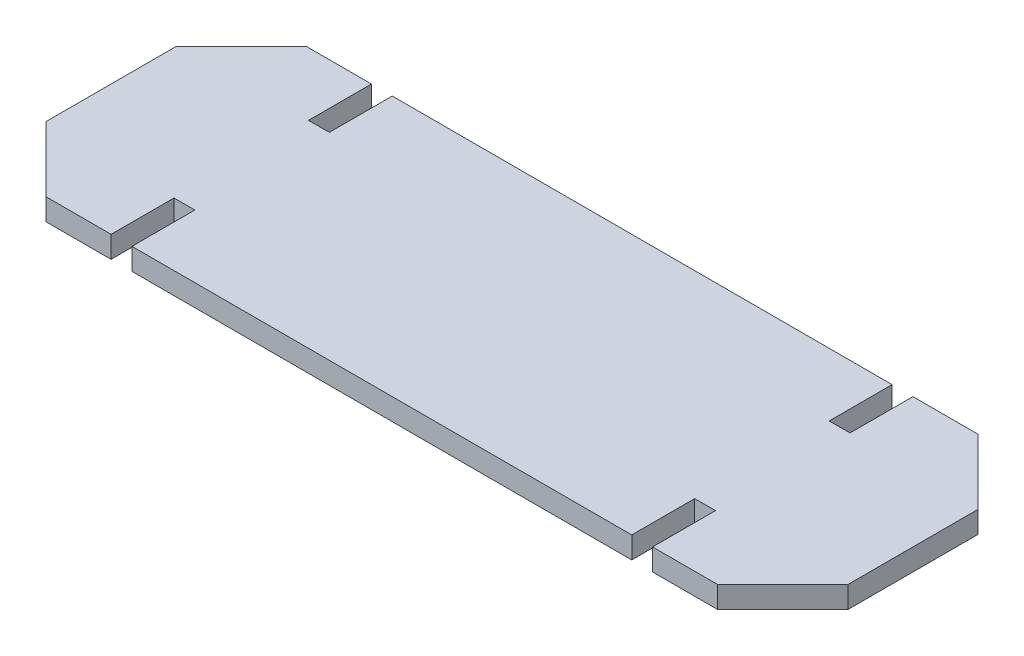
ISO-10303-21;
HEADER;
FILE_DESCRIPTION(('STEP AP214'),'2;1');
FILE_NAME('part.step','',(''),(''),'','','');
FILE_SCHEMA(('AUTOMOTIVE_DESIGN { 1 0 10303 214 1 1 1 1 }'));
ENDSEC;
DATA;
#1=APPLICATION_CONTEXT('core data for automotive mechanical design processes');
#2=APPLICATION_PROTOCOL_DEFINITION('international standard','automotive_design',2000,#1);
#3=PRODUCT_CONTEXT('',#1,'mechanical');
#4=PRODUCT('Part','Part','',(#3));
#5=PRODUCT_RELATED_PRODUCT_CATEGORY('part','',(#4));
#6=PRODUCT_DEFINITION_FORMATION('','',#4);
#7=PRODUCT_DEFINITION_CONTEXT('part definition',#1,'design');
#8=PRODUCT_DEFINITION('design','',#6,#7);
#9=PRODUCT_DEFINITION_SHAPE('','',#8);
#10=(LENGTH_UNIT() NAMED_UNIT(*) SI_UNIT(.MILLI.,.METRE.));
#11=(NAMED_UNIT(*) PLANE_ANGLE_UNIT() SI_UNIT($,.RADIAN.));
#12=(NAMED_UNIT(*) SI_UNIT($,.STERADIAN.) SOLID_ANGLE_UNIT());
#13=UNCERTAINTY_MEASURE_WITH_UNIT(LENGTH_MEASURE(1.E-05),#10,'distance_accuracy_value','');
#14=(GEOMETRIC_REPRESENTATION_CONTEXT(3) GLOBAL_UNCERTAINTY_ASSIGNED_CONTEXT((#13)) GLOBAL_UNIT_ASSIGNED_CONTEXT((#10,
#11,#12)) REPRESENTATION_CONTEXT('',''));
#15=CARTESIAN_POINT('',(0.,0.,0.));
#16=DIRECTION('',(0.,0.,1.));
#17=DIRECTION('',(1.,0.,0.));
#18=AXIS2_PLACEMENT_3D('',#15,#16,#17);
#19=CARTESIAN_POINT('',(0.,12.7,-76.1999999999999));
#20=DIRECTION('',(0.,0.,-1.));
#21=DIRECTION('',(-1.,0.,0.));
#22=AXIS2_PLACEMENT_3D('',#19,#20,#21);
#23=PLANE('',#22);
#24=DIRECTION('',(1.,0.,0.));
#25=VECTOR('',#24,1.);
#26=CARTESIAN_POINT('',(0.,0.,-76.1999999999999));
#27=LINE('',#26,#25);
#28=CARTESIAN_POINT('',(158.496,0.,-76.1999999999999));
#29=VERTEX_POINT('',#28);
#30=CARTESIAN_POINT('',(196.596,0.,-76.1999999999999));
#31=VERTEX_POINT('',#30);
#32=EDGE_CURVE('E226',#29,#31,#27,.T.);
#33=ORIENTED_EDGE('',*,*,#32,.F.);
#34=DIRECTION('',(0.,-1.,0.));
#35=VECTOR('',#34,1.);
#36=CARTESIAN_POINT('',(158.496,12.7,-76.1999999999999));
#37=LINE('',#36,#35);
#38=CARTESIAN_POINT('',(158.496,12.7,-76.1999999999999));
#39=VERTEX_POINT('',#38);
#40=EDGE_CURVE('E11',#39,#29,#37,.T.);
#41=ORIENTED_EDGE('',*,*,#40,.F.);
#42=DIRECTION('',(1.,0.,0.));
#43=VECTOR('',#42,1.);
#44=CARTESIAN_POINT('',(0.,12.7,-76.1999999999999));
#45=LINE('',#44,#43);
#46=CARTESIAN_POINT('',(196.596,12.7,-76.1999999999999));
#47=VERTEX_POINT('',#46);
#48=EDGE_CURVE('E287',#39,#47,#45,.T.);
#49=ORIENTED_EDGE('',*,*,#48,.T.);
#50=DIRECTION('',(0.,-1.,0.));
#51=VECTOR('',#50,1.);
#52=CARTESIAN_POINT('',(196.596,12.7,-76.1999999999999));
#53=LINE('',#52,#51);
#54=EDGE_CURVE('E51',#47,#31,#53,.T.);
#55=ORIENTED_EDGE('',*,*,#54,.T.);
#56=EDGE_LOOP('',(#33,#41,#49,#55));
#57=FACE_BOUND('',#56,.T.);
#58=ADVANCED_FACE('F35',(#57),#23,.T.);
#59=CARTESIAN_POINT('',(158.496,12.7,0.));
#60=DIRECTION('',(1.,0.,0.));
#61=DIRECTION('',(0.,0.,-1.));
#62=AXIS2_PLACEMENT_3D('',#59,#60,#61);
#63=PLANE('',#62);
#64=DIRECTION('',(0.,0.,1.));
#65=VECTOR('',#64,1.);
#66=CARTESIAN_POINT('',(158.496,0.,0.));
#67=LINE('',#66,#65);
#68=CARTESIAN_POINT('',(158.496,0.,-39.37));
#69=VERTEX_POINT('',#68);
#70=EDGE_CURVE('E228',#29,#69,#67,.T.);
#71=ORIENTED_EDGE('',*,*,#70,.T.);
#72=DIRECTION('',(0.,-1.,0.));
#73=VECTOR('',#72,1.);
#74=CARTESIAN_POINT('',(158.496,12.7,-39.37));
#75=LINE('',#74,#73);
#76=CARTESIAN_POINT('',(158.496,12.7,-39.37));
#77=VERTEX_POINT('',#76);
#78=EDGE_CURVE('E43',#77,#69,#75,.T.);
#79=ORIENTED_EDGE('',*,*,#78,.F.);
#80=DIRECTION('',(0.,0.,1.));
#81=VECTOR('',#80,1.);
#82=CARTESIAN_POINT('',(158.496,12.7,0.));
#83=LINE('',#82,#81);
#84=EDGE_CURVE('E354',#39,#77,#83,.T.);
#85=ORIENTED_EDGE('',*,*,#84,.F.);
#86=ORIENTED_EDGE('',*,*,#40,.T.);
#87=EDGE_LOOP('',(#71,#79,#85,#86));
#88=FACE_BOUND('',#87,.T.);
#89=ADVANCED_FACE('F341',(#88),#63,.F.);
#90=CARTESIAN_POINT('',(0.,12.7,-39.37));
#91=DIRECTION('',(0.,0.,-1.));
#92=DIRECTION('',(-1.,0.,0.));
#93=AXIS2_PLACEMENT_3D('',#90,#91,#92);
#94=PLANE('',#93);
#95=DIRECTION('',(1.,0.,0.));
#96=VECTOR('',#95,1.);
#97=CARTESIAN_POINT('',(0.,0.,-39.37));
#98=LINE('',#97,#96);
#99=CARTESIAN_POINT('',(146.304,0.,-39.37));
#100=VERTEX_POINT('',#99);
#101=EDGE_CURVE('E231',#100,#69,#98,.T.);
#102=ORIENTED_EDGE('',*,*,#101,.F.);
#103=DIRECTION('',(0.,-1.,0.));
#104=VECTOR('',#103,1.);
#105=CARTESIAN_POINT('',(146.304,12.7,-39.37));
#106=LINE('',#105,#104);
#107=CARTESIAN_POINT('',(146.304,12.7,-39.37));
#108=VERTEX_POINT('',#107);
#109=EDGE_CURVE('E331',#108,#100,#106,.T.);
#110=ORIENTED_EDGE('',*,*,#109,.F.);
#111=DIRECTION('',(1.,0.,0.));
#112=VECTOR('',#111,1.);
#113=CARTESIAN_POINT('',(0.,12.7,-39.37));
#114=LINE('',#113,#112);
#115=EDGE_CURVE('E338',#108,#77,#114,.T.);
#116=ORIENTED_EDGE('',*,*,#115,.T.);
#117=ORIENTED_EDGE('',*,*,#78,.T.);
#118=EDGE_LOOP('',(#102,#110,#116,#117));
#119=FACE_BOUND('',#118,.T.);
#120=ADVANCED_FACE('F336',(#119),#94,.T.);
#121=CARTESIAN_POINT('',(146.304,12.7,0.));
#122=DIRECTION('',(1.,0.,0.));
#123=DIRECTION('',(0.,0.,-1.));
#124=AXIS2_PLACEMENT_3D('',#121,#122,#123);
#125=PLANE('',#124);
#126=DIRECTION('',(0.,0.,1.));
#127=VECTOR('',#126,1.);
#128=CARTESIAN_POINT('',(146.304,0.,0.));
#129=LINE('',#128,#127);
#130=CARTESIAN_POINT('',(146.304,0.,-76.1999999999999));
#131=VERTEX_POINT('',#130);
#132=EDGE_CURVE('E234',#131,#100,#129,.T.);
#133=ORIENTED_EDGE('',*,*,#132,.F.);
#134=DIRECTION('',(0.,-1.,0.));
#135=VECTOR('',#134,1.);
#136=CARTESIAN_POINT('',(146.304,12.7,-76.1999999999999));
#137=LINE('',#136,#135);
#138=CARTESIAN_POINT('',(146.304,12.7,-76.1999999999999));
#139=VERTEX_POINT('',#138);
#140=EDGE_CURVE('E329',#139,#131,#137,.T.);
#141=ORIENTED_EDGE('',*,*,#140,.F.);
#142=DIRECTION('',(0.,0.,1.));
#143=VECTOR('',#142,1.);
#144=CARTESIAN_POINT('',(146.304,12.7,0.));
#145=LINE('',#144,#143);
#146=EDGE_CURVE('E351',#139,#108,#145,.T.);
#147=ORIENTED_EDGE('',*,*,#146,.T.);
#148=ORIENTED_EDGE('',*,*,#109,.T.);
#149=EDGE_LOOP('',(#133,#141,#147,#148));
#150=FACE_BOUND('',#149,.T.);
#151=ADVANCED_FACE('F348',(#150),#125,.T.);
#152=CARTESIAN_POINT('',(0.,12.7,-76.1999999999999));
#153=DIRECTION('',(0.,0.,-1.));
#154=DIRECTION('',(-1.,0.,0.));
#155=AXIS2_PLACEMENT_3D('',#152,#153,#154);
#156=PLANE('',#155);
#157=DIRECTION('',(1.,0.,0.));
#158=VECTOR('',#157,1.);
#159=CARTESIAN_POINT('',(0.,0.,-76.1999999999999));
#160=LINE('',#159,#158);
#161=CARTESIAN_POINT('',(-146.304,0.,-76.1999999999999));
#162=VERTEX_POINT('',#161);
#163=EDGE_CURVE('E237',#162,#131,#160,.T.);
#164=ORIENTED_EDGE('',*,*,#163,.F.);
#165=DIRECTION('',(0.,-1.,0.));
#166=VECTOR('',#165,1.);
#167=CARTESIAN_POINT('',(-146.304,12.7,-76.1999999999999));
#168=LINE('',#167,#166);
#169=CARTESIAN_POINT('',(-146.304,12.7,-76.1999999999999));
#170=VERTEX_POINT('',#169);
#171=EDGE_CURVE('E327',#170,#162,#168,.T.);
#172=ORIENTED_EDGE('',*,*,#171,.F.);
#173=DIRECTION('',(1.,0.,0.));
#174=VECTOR('',#173,1.);
#175=CARTESIAN_POINT('',(0.,12.7,-76.1999999999999));
#176=LINE('',#175,#174);
#177=EDGE_CURVE('E356',#170,#139,#176,.T.);
#178=ORIENTED_EDGE('',*,*,#177,.T.);
#179=ORIENTED_EDGE('',*,*,#140,.T.);
#180=EDGE_LOOP('',(#164,#172,#178,#179));
#181=FACE_BOUND('',#180,.T.);
#182=ADVANCED_FACE('F604',(#181),#156,.T.);
#183=CARTESIAN_POINT('',(-146.304,12.7,0.));
#184=DIRECTION('',(1.,0.,0.));
#185=DIRECTION('',(0.,0.,-1.));
#186=AXIS2_PLACEMENT_3D('',#183,#184,#185);
#187=PLANE('',#186);
#188=DIRECTION('',(0.,0.,1.));
#189=VECTOR('',#188,1.);
#190=CARTESIAN_POINT('',(-146.304,0.,0.));
#191=LINE('',#190,#189);
#192=CARTESIAN_POINT('',(-146.304,0.,-39.37));
#193=VERTEX_POINT('',#192);
#194=EDGE_CURVE('E240',#162,#193,#191,.T.);
#195=ORIENTED_EDGE('',*,*,#194,.T.);
#196=DIRECTION('',(0.,-1.,0.));
#197=VECTOR('',#196,1.);
#198=CARTESIAN_POINT('',(-146.304,12.7,-39.37));
#199=LINE('',#198,#197);
#200=CARTESIAN_POINT('',(-146.304,12.7,-39.37));
#201=VERTEX_POINT('',#200);
#202=EDGE_CURVE('E325',#201,#193,#199,.T.);
#203=ORIENTED_EDGE('',*,*,#202,.F.);
#204=DIRECTION('',(0.,0.,1.));
#205=VECTOR('',#204,1.);
#206=CARTESIAN_POINT('',(-146.304,12.7,0.));
#207=LINE('',#206,#205);
#208=EDGE_CURVE('E362',#170,#201,#207,.T.);
#209=ORIENTED_EDGE('',*,*,#208,.F.);
#210=ORIENTED_EDGE('',*,*,#171,.T.);
#211=EDGE_LOOP('',(#195,#203,#209,#210));
#212=FACE_BOUND('',#211,.T.);
#213=ADVANCED_FACE('F594',(#212),#187,.F.);
#214=CARTESIAN_POINT('',(0.,12.7,-39.37));
#215=DIRECTION('',(0.,0.,-1.));
#216=DIRECTION('',(-1.,0.,0.));
#217=AXIS2_PLACEMENT_3D('',#214,#215,#216);
#218=PLANE('',#217);
#219=DIRECTION('',(1.,0.,0.));
#220=VECTOR('',#219,1.);
#221=CARTESIAN_POINT('',(0.,0.,-39.37));
#222=LINE('',#221,#220);
#223=CARTESIAN_POINT('',(-158.496,0.,-39.37));
#224=VERTEX_POINT('',#223);
#225=EDGE_CURVE('E243',#224,#193,#222,.T.);
#226=ORIENTED_EDGE('',*,*,#225,.F.);
#227=DIRECTION('',(0.,-1.,0.));
#228=VECTOR('',#227,1.);
#229=CARTESIAN_POINT('',(-158.496,12.7,-39.37));
#230=LINE('',#229,#228);
#231=CARTESIAN_POINT('',(-158.496,12.7,-39.37));
#232=VERTEX_POINT('',#231);
#233=EDGE_CURVE('E323',#232,#224,#230,.T.);
#234=ORIENTED_EDGE('',*,*,#233,.F.);
#235=DIRECTION('',(1.,0.,0.));
#236=VECTOR('',#235,1.);
#237=CARTESIAN_POINT('',(0.,12.7,-39.37));
#238=LINE('',#237,#236);
#239=EDGE_CURVE('E364',#232,#201,#238,.T.);
#240=ORIENTED_EDGE('',*,*,#239,.T.);
#241=ORIENTED_EDGE('',*,*,#202,.T.);
#242=EDGE_LOOP('',(#226,#234,#240,#241));
#243=FACE_BOUND('',#242,.T.);
#244=ADVANCED_FACE('F584',(#243),#218,.T.);
#245=CARTESIAN_POINT('',(-158.496,12.7,0.));
#246=DIRECTION('',(1.,0.,0.));
#247=DIRECTION('',(0.,0.,-1.));
#248=AXIS2_PLACEMENT_3D('',#245,#246,#247);
#249=PLANE('',#248);
#250=DIRECTION('',(0.,0.,1.));
#251=VECTOR('',#250,1.);
#252=CARTESIAN_POINT('',(-158.496,0.,0.));
#253=LINE('',#252,#251);
#254=CARTESIAN_POINT('',(-158.496,0.,-76.1999999999999));
#255=VERTEX_POINT('',#254);
#256=EDGE_CURVE('E246',#255,#224,#253,.T.);
#257=ORIENTED_EDGE('',*,*,#256,.F.);
#258=DIRECTION('',(0.,-1.,0.));
#259=VECTOR('',#258,1.);
#260=CARTESIAN_POINT('',(-158.496,12.7,-76.1999999999999));
#261=LINE('',#260,#259);
#262=CARTESIAN_POINT('',(-158.496,12.7,-76.1999999999999));
#263=VERTEX_POINT('',#262);
#264=EDGE_CURVE('E321',#263,#255,#261,.T.);
#265=ORIENTED_EDGE('',*,*,#264,.F.);
#266=DIRECTION('',(0.,0.,1.));
#267=VECTOR('',#266,1.);
#268=CARTESIAN_POINT('',(-158.496,12.7,0.));
#269=LINE('',#268,#267);
#270=EDGE_CURVE('E367',#263,#232,#269,.T.);
#271=ORIENTED_EDGE('',*,*,#270,.T.);
#272=ORIENTED_EDGE('',*,*,#233,.T.);
#273=EDGE_LOOP('',(#257,#265,#271,#272));
#274=FACE_BOUND('',#273,.T.);
#275=ADVANCED_FACE('F574',(#274),#249,.T.);
#276=CARTESIAN_POINT('',(0.,12.7,-76.1999999999999));
#277=DIRECTION('',(0.,0.,-1.));
#278=DIRECTION('',(-1.,0.,0.));
#279=AXIS2_PLACEMENT_3D('',#276,#277,#278);
#280=PLANE('',#279);
#281=DIRECTION('',(1.,0.,0.));
#282=VECTOR('',#281,1.);
#283=CARTESIAN_POINT('',(0.,0.,-76.1999999999999));
#284=LINE('',#283,#282);
#285=CARTESIAN_POINT('',(-196.596,0.,-76.1999999999999));
#286=VERTEX_POINT('',#285);
#287=EDGE_CURVE('E249',#286,#255,#284,.T.);
#288=ORIENTED_EDGE('',*,*,#287,.F.);
#289=DIRECTION('',(0.,-1.,0.));
#290=VECTOR('',#289,1.);
#291=CARTESIAN_POINT('',(-196.596,12.7,-76.1999999999999));
#292=LINE('',#291,#290);
#293=CARTESIAN_POINT('',(-196.596,12.7,-76.1999999999999));
#294=VERTEX_POINT('',#293);
#295=EDGE_CURVE('E319',#294,#286,#292,.T.);
#296=ORIENTED_EDGE('',*,*,#295,.F.);
#297=DIRECTION('',(1.,0.,0.));
#298=VECTOR('',#297,1.);
#299=CARTESIAN_POINT('',(0.,12.7,-76.1999999999999));
#300=LINE('',#299,#298);
#301=EDGE_CURVE('E370',#294,#263,#300,.T.);
#302=ORIENTED_EDGE('',*,*,#301,.T.);
#303=ORIENTED_EDGE('',*,*,#264,.T.);
#304=EDGE_LOOP('',(#288,#296,#302,#303));
#305=FACE_BOUND('',#304,.T.);
#306=ADVANCED_FACE('F564',(#305),#280,.T.);
#307=CARTESIAN_POINT('',(-136.398000000001,12.7,-136.398));
#308=DIRECTION('',(-0.707106781186551,0.,-0.707106781186543));
#309=DIRECTION('',(-0.707106781186544,0.,0.707106781186551));
#310=AXIS2_PLACEMENT_3D('',#307,#308,#309);
#311=PLANE('',#310);
#312=DIRECTION('',(0.707106781186544,0.,-0.707106781186551));
#313=VECTOR('',#312,1.);
#314=CARTESIAN_POINT('',(-136.398000000001,0.,-136.398));
#315=LINE('',#314,#313);
#316=CARTESIAN_POINT('',(-234.696,0.,-38.1));
#317=VERTEX_POINT('',#316);
#318=EDGE_CURVE('E252',#317,#286,#315,.T.);
#319=ORIENTED_EDGE('',*,*,#318,.F.);
#320=DIRECTION('',(0.,-1.,0.));
#321=VECTOR('',#320,1.);
#322=CARTESIAN_POINT('',(-234.696,12.7,-38.1));
#323=LINE('',#322,#321);
#324=CARTESIAN_POINT('',(-234.696,12.7,-38.1));
#325=VERTEX_POINT('',#324);
#326=EDGE_CURVE('E317',#325,#317,#323,.T.);
#327=ORIENTED_EDGE('',*,*,#326,.F.);
#328=DIRECTION('',(0.707106781186544,0.,-0.707106781186551));
#329=VECTOR('',#328,1.);
#330=CARTESIAN_POINT('',(-136.398000000001,12.7,-136.398));
#331=LINE('',#330,#329);
#332=EDGE_CURVE('E373',#325,#294,#331,.T.);
#333=ORIENTED_EDGE('',*,*,#332,.T.);
#334=ORIENTED_EDGE('',*,*,#295,.T.);
#335=EDGE_LOOP('',(#319,#327,#333,#334));
#336=FACE_BOUND('',#335,.T.);
#337=ADVANCED_FACE('F554',(#336),#311,.T.);
#338=CARTESIAN_POINT('',(-234.696,12.7,1.70974345792274E-13));
#339=DIRECTION('',(1.,0.,0.));
#340=DIRECTION('',(0.,0.,-1.));
#341=AXIS2_PLACEMENT_3D('',#338,#339,#340);
#342=PLANE('',#341);
#343=DIRECTION('',(0.,0.,1.));
#344=VECTOR('',#343,1.);
#345=CARTESIAN_POINT('',(-234.696,0.,1.70974345792274E-13));
#346=LINE('',#345,#344);
#347=CARTESIAN_POINT('',(-234.696,0.,38.1));
#348=VERTEX_POINT('',#347);
#349=EDGE_CURVE('E255',#317,#348,#346,.T.);
#350=ORIENTED_EDGE('',*,*,#349,.T.);
#351=DIRECTION('',(0.,-1.,0.));
#352=VECTOR('',#351,1.);
#353=CARTESIAN_POINT('',(-234.696,12.7,38.1));
#354=LINE('',#353,#352);
#355=CARTESIAN_POINT('',(-234.696,12.7,38.1));
#356=VERTEX_POINT('',#355);
#357=EDGE_CURVE('E314',#356,#348,#354,.T.);
#358=ORIENTED_EDGE('',*,*,#357,.F.);
#359=DIRECTION('',(0.,0.,1.));
#360=VECTOR('',#359,1.);
#361=CARTESIAN_POINT('',(-234.696,12.7,1.70974345792274E-13));
#362=LINE('',#361,#360);
#363=EDGE_CURVE('E376',#325,#356,#362,.T.);
#364=ORIENTED_EDGE('',*,*,#363,.F.);
#365=ORIENTED_EDGE('',*,*,#326,.T.);
#366=EDGE_LOOP('',(#350,#358,#364,#365));
#367=FACE_BOUND('',#366,.T.);
#368=ADVANCED_FACE('F544',(#367),#342,.F.);
#369=CARTESIAN_POINT('',(-136.397999999999,12.7,136.398));
#370=DIRECTION('',(0.707106781186546,0.,-0.707106781186549));
#371=DIRECTION('',(-0.707106781186549,0.,-0.707106781186546));
#372=AXIS2_PLACEMENT_3D('',#369,#370,#371);
#373=PLANE('',#372);
#374=DIRECTION('',(0.707106781186549,0.,0.707106781186546));
#375=VECTOR('',#374,1.);
#376=CARTESIAN_POINT('',(-136.397999999999,0.,136.398));
#377=LINE('',#376,#375);
#378=CARTESIAN_POINT('',(-196.596,0.,76.2));
#379=VERTEX_POINT('',#378);
#380=EDGE_CURVE('E257',#348,#379,#377,.T.);
#381=ORIENTED_EDGE('',*,*,#380,.T.);
#382=DIRECTION('',(0.,-1.,0.));
#383=VECTOR('',#382,1.);
#384=CARTESIAN_POINT('',(-196.596,12.7,76.2));
#385=LINE('',#384,#383);
#386=CARTESIAN_POINT('',(-196.596,12.7,76.2));
#387=VERTEX_POINT('',#386);
#388=EDGE_CURVE('E311',#387,#379,#385,.T.);
#389=ORIENTED_EDGE('',*,*,#388,.F.);
#390=DIRECTION('',(0.707106781186549,0.,0.707106781186546));
#391=VECTOR('',#390,1.);
#392=CARTESIAN_POINT('',(-136.397999999999,12.7,136.398));
#393=LINE('',#392,#391);
#394=EDGE_CURVE('E378',#356,#387,#393,.T.);
#395=ORIENTED_EDGE('',*,*,#394,.F.);
#396=ORIENTED_EDGE('',*,*,#357,.T.);
#397=EDGE_LOOP('',(#381,#389,#395,#396));
#398=FACE_BOUND('',#397,.T.);
#399=ADVANCED_FACE('F534',(#398),#373,.F.);
#400=CARTESIAN_POINT('',(0.,12.7,76.2));
#401=DIRECTION('',(0.,0.,-1.));
#402=DIRECTION('',(-1.,0.,0.));
#403=AXIS2_PLACEMENT_3D('',#400,#401,#402);
#404=PLANE('',#403);
#405=DIRECTION('',(1.,0.,0.));
#406=VECTOR('',#405,1.);
#407=CARTESIAN_POINT('',(0.,0.,76.2));
#408=LINE('',#407,#406);
#409=CARTESIAN_POINT('',(-158.496,0.,76.2));
#410=VERTEX_POINT('',#409);
#411=EDGE_CURVE('E259',#379,#410,#408,.T.);
#412=ORIENTED_EDGE('',*,*,#411,.T.);
#413=DIRECTION('',(0.,-1.,0.));
#414=VECTOR('',#413,1.);
#415=CARTESIAN_POINT('',(-158.496,12.7,76.2));
#416=LINE('',#415,#414);
#417=CARTESIAN_POINT('',(-158.496,12.7,76.2));
#418=VERTEX_POINT('',#417);
#419=EDGE_CURVE('E308',#418,#410,#416,.T.);
#420=ORIENTED_EDGE('',*,*,#419,.F.);
#421=DIRECTION('',(1.,0.,0.));
#422=VECTOR('',#421,1.);
#423=CARTESIAN_POINT('',(0.,12.7,76.2));
#424=LINE('',#423,#422);
#425=EDGE_CURVE('E380',#387,#418,#424,.T.);
#426=ORIENTED_EDGE('',*,*,#425,.F.);
#427=ORIENTED_EDGE('',*,*,#388,.T.);
#428=EDGE_LOOP('',(#412,#420,#426,#427));
#429=FACE_BOUND('',#428,.T.);
#430=ADVANCED_FACE('F524',(#429),#404,.F.);
#431=CARTESIAN_POINT('',(-158.496,12.7,0.));
#432=DIRECTION('',(-1.,0.,0.));
#433=DIRECTION('',(0.,0.,1.));
#434=AXIS2_PLACEMENT_3D('',#431,#432,#433);
#435=PLANE('',#434);
#436=DIRECTION('',(0.,0.,-1.));
#437=VECTOR('',#436,1.);
#438=CARTESIAN_POINT('',(-158.496,0.,0.));
#439=LINE('',#438,#437);
#440=CARTESIAN_POINT('',(-158.496,0.,39.37));
#441=VERTEX_POINT('',#440);
#442=EDGE_CURVE('E261',#410,#441,#439,.T.);
#443=ORIENTED_EDGE('',*,*,#442,.T.);
#444=DIRECTION('',(0.,-1.,0.));
#445=VECTOR('',#444,1.);
#446=CARTESIAN_POINT('',(-158.496,12.7,39.37));
#447=LINE('',#446,#445);
#448=CARTESIAN_POINT('',(-158.496,12.7,39.37));
#449=VERTEX_POINT('',#448);
#450=EDGE_CURVE('E305',#449,#441,#447,.T.);
#451=ORIENTED_EDGE('',*,*,#450,.F.);
#452=DIRECTION('',(0.,0.,-1.));
#453=VECTOR('',#452,1.);
#454=CARTESIAN_POINT('',(-158.496,12.7,0.));
#455=LINE('',#454,#453);
#456=EDGE_CURVE('E382',#418,#449,#455,.T.);
#457=ORIENTED_EDGE('',*,*,#456,.F.);
#458=ORIENTED_EDGE('',*,*,#419,.T.);
#459=EDGE_LOOP('',(#443,#451,#457,#458));
#460=FACE_BOUND('',#459,.T.);
#461=ADVANCED_FACE('F514',(#460),#435,.F.);
#462=CARTESIAN_POINT('',(0.,12.7,39.37));
#463=DIRECTION('',(0.,0.,-1.));
#464=DIRECTION('',(-1.,0.,0.));
#465=AXIS2_PLACEMENT_3D('',#462,#463,#464);
#466=PLANE('',#465);
#467=DIRECTION('',(1.,0.,0.));
#468=VECTOR('',#467,1.);
#469=CARTESIAN_POINT('',(0.,0.,39.37));
#470=LINE('',#469,#468);
#471=CARTESIAN_POINT('',(-146.304,0.,39.37));
#472=VERTEX_POINT('',#471);
#473=EDGE_CURVE('E263',#441,#472,#470,.T.);
#474=ORIENTED_EDGE('',*,*,#473,.T.);
#475=DIRECTION('',(0.,-1.,0.));
#476=VECTOR('',#475,1.);
#477=CARTESIAN_POINT('',(-146.304,12.7,39.37));
#478=LINE('',#477,#476);
#479=CARTESIAN_POINT('',(-146.304,12.7,39.37));
#480=VERTEX_POINT('',#479);
#481=EDGE_CURVE('E303',#480,#472,#478,.T.);
#482=ORIENTED_EDGE('',*,*,#481,.F.);
#483=DIRECTION('',(1.,0.,0.));
#484=VECTOR('',#483,1.);
#485=CARTESIAN_POINT('',(0.,12.7,39.37));
#486=LINE('',#485,#484);
#487=EDGE_CURVE('E384',#449,#480,#486,.T.);
#488=ORIENTED_EDGE('',*,*,#487,.F.);
#489=ORIENTED_EDGE('',*,*,#450,.T.);
#490=EDGE_LOOP('',(#474,#482,#488,#489));
#491=FACE_BOUND('',#490,.T.);
#492=ADVANCED_FACE('F504',(#491),#466,.F.);
#493=CARTESIAN_POINT('',(-146.304,12.7,0.));
#494=DIRECTION('',(-1.,0.,0.));
#495=DIRECTION('',(0.,0.,1.));
#496=AXIS2_PLACEMENT_3D('',#493,#494,#495);
#497=PLANE('',#496);
#498=DIRECTION('',(0.,0.,-1.));
#499=VECTOR('',#498,1.);
#500=CARTESIAN_POINT('',(-146.304,0.,0.));
#501=LINE('',#500,#499);
#502=CARTESIAN_POINT('',(-146.304,0.,76.2));
#503=VERTEX_POINT('',#502);
#504=EDGE_CURVE('E266',#503,#472,#501,.T.);
#505=ORIENTED_EDGE('',*,*,#504,.F.);
#506=DIRECTION('',(0.,-1.,0.));
#507=VECTOR('',#506,1.);
#508=CARTESIAN_POINT('',(-146.304,12.7,76.2));
#509=LINE('',#508,#507);
#510=CARTESIAN_POINT('',(-146.304,12.7,76.2));
#511=VERTEX_POINT('',#510);
#512=EDGE_CURVE('E301',#511,#503,#509,.T.);
#513=ORIENTED_EDGE('',*,*,#512,.F.);
#514=DIRECTION('',(0.,0.,-1.));
#515=VECTOR('',#514,1.);
#516=CARTESIAN_POINT('',(-146.304,12.7,0.));
#517=LINE('',#516,#515);
#518=EDGE_CURVE('E386',#511,#480,#517,.T.);
#519=ORIENTED_EDGE('',*,*,#518,.T.);
#520=ORIENTED_EDGE('',*,*,#481,.T.);
#521=EDGE_LOOP('',(#505,#513,#519,#520));
#522=FACE_BOUND('',#521,.T.);
#523=ADVANCED_FACE('F494',(#522),#497,.T.);
#524=CARTESIAN_POINT('',(0.,12.7,76.2));
#525=DIRECTION('',(0.,0.,-1.));
#526=DIRECTION('',(-1.,0.,0.));
#527=AXIS2_PLACEMENT_3D('',#524,#525,#526);
#528=PLANE('',#527);
#529=DIRECTION('',(1.,0.,0.));
#530=VECTOR('',#529,1.);
#531=CARTESIAN_POINT('',(0.,0.,76.2));
#532=LINE('',#531,#530);
#533=CARTESIAN_POINT('',(146.304,0.,76.2));
#534=VERTEX_POINT('',#533);
#535=EDGE_CURVE('E269',#503,#534,#532,.T.);
#536=ORIENTED_EDGE('',*,*,#535,.T.);
#537=DIRECTION('',(0.,-1.,0.));
#538=VECTOR('',#537,1.);
#539=CARTESIAN_POINT('',(146.304,12.7,76.2));
#540=LINE('',#539,#538);
#541=CARTESIAN_POINT('',(146.304,12.7,76.2));
#542=VERTEX_POINT('',#541);
#543=EDGE_CURVE('E298',#542,#534,#540,.T.);
#544=ORIENTED_EDGE('',*,*,#543,.F.);
#545=DIRECTION('',(1.,0.,0.));
#546=VECTOR('',#545,1.);
#547=CARTESIAN_POINT('',(0.,12.7,76.2));
#548=LINE('',#547,#546);
#549=EDGE_CURVE('E389',#511,#542,#548,.T.);
#550=ORIENTED_EDGE('',*,*,#549,.F.);
#551=ORIENTED_EDGE('',*,*,#512,.T.);
#552=EDGE_LOOP('',(#536,#544,#550,#551));
#553=FACE_BOUND('',#552,.T.);
#554=ADVANCED_FACE('F484',(#553),#528,.F.);
#555=CARTESIAN_POINT('',(146.304,12.7,0.));
#556=DIRECTION('',(-1.,0.,0.));
#557=DIRECTION('',(0.,0.,1.));
#558=AXIS2_PLACEMENT_3D('',#555,#556,#557);
#559=PLANE('',#558);
#560=DIRECTION('',(0.,0.,-1.));
#561=VECTOR('',#560,1.);
#562=CARTESIAN_POINT('',(146.304,0.,0.));
#563=LINE('',#562,#561);
#564=CARTESIAN_POINT('',(146.304,0.,39.37));
#565=VERTEX_POINT('',#564);
#566=EDGE_CURVE('E271',#534,#565,#563,.T.);
#567=ORIENTED_EDGE('',*,*,#566,.T.);
#568=DIRECTION('',(0.,-1.,0.));
#569=VECTOR('',#568,1.);
#570=CARTESIAN_POINT('',(146.304,12.7,39.37));
#571=LINE('',#570,#569);
#572=CARTESIAN_POINT('',(146.304,12.7,39.37));
#573=VERTEX_POINT('',#572);
#574=EDGE_CURVE('E295',#573,#565,#571,.T.);
#575=ORIENTED_EDGE('',*,*,#574,.F.);
#576=DIRECTION('',(0.,0.,-1.));
#577=VECTOR('',#576,1.);
#578=CARTESIAN_POINT('',(146.304,12.7,0.));
#579=LINE('',#578,#577);
#580=EDGE_CURVE('E391',#542,#573,#579,.T.);
#581=ORIENTED_EDGE('',*,*,#580,.F.);
#582=ORIENTED_EDGE('',*,*,#543,.T.);
#583=EDGE_LOOP('',(#567,#575,#581,#582));
#584=FACE_BOUND('',#583,.T.);
#585=ADVANCED_FACE('F475',(#584),#559,.F.);
#586=CARTESIAN_POINT('',(0.,12.7,39.37));
#587=DIRECTION('',(0.,0.,-1.));
#588=DIRECTION('',(-1.,0.,0.));
#589=AXIS2_PLACEMENT_3D('',#586,#587,#588);
#590=PLANE('',#589);
#591=DIRECTION('',(1.,0.,0.));
#592=VECTOR('',#591,1.);
#593=CARTESIAN_POINT('',(0.,0.,39.37));
#594=LINE('',#593,#592);
#595=CARTESIAN_POINT('',(158.496,0.,39.37));
#596=VERTEX_POINT('',#595);
#597=EDGE_CURVE('E273',#565,#596,#594,.T.);
#598=ORIENTED_EDGE('',*,*,#597,.T.);
#599=DIRECTION('',(0.,-1.,0.));
#600=VECTOR('',#599,1.);
#601=CARTESIAN_POINT('',(158.496,12.7,39.37));
#602=LINE('',#601,#600);
#603=CARTESIAN_POINT('',(158.496,12.7,39.37));
#604=VERTEX_POINT('',#603);
#605=EDGE_CURVE('E293',#604,#596,#602,.T.);
#606=ORIENTED_EDGE('',*,*,#605,.F.);
#607=DIRECTION('',(1.,0.,0.));
#608=VECTOR('',#607,1.);
#609=CARTESIAN_POINT('',(0.,12.7,39.37));
#610=LINE('',#609,#608);
#611=EDGE_CURVE('E393',#573,#604,#610,.T.);
#612=ORIENTED_EDGE('',*,*,#611,.F.);
#613=ORIENTED_EDGE('',*,*,#574,.T.);
#614=EDGE_LOOP('',(#598,#606,#612,#613));
#615=FACE_BOUND('',#614,.T.);
#616=ADVANCED_FACE('F405',(#615),#590,.F.);
#617=CARTESIAN_POINT('',(158.496,12.7,0.));
#618=DIRECTION('',(-1.,0.,0.));
#619=DIRECTION('',(0.,0.,1.));
#620=AXIS2_PLACEMENT_3D('',#617,#618,#619);
#621=PLANE('',#620);
#622=DIRECTION('',(0.,0.,-1.));
#623=VECTOR('',#622,1.);
#624=CARTESIAN_POINT('',(158.496,0.,0.));
#625=LINE('',#624,#623);
#626=CARTESIAN_POINT('',(158.496,0.,76.2));
#627=VERTEX_POINT('',#626);
#628=EDGE_CURVE('E276',#627,#596,#625,.T.);
#629=ORIENTED_EDGE('',*,*,#628,.F.);
#630=DIRECTION('',(0.,-1.,0.));
#631=VECTOR('',#630,1.);
#632=CARTESIAN_POINT('',(158.496,12.7,76.2));
#633=LINE('',#632,#631);
#634=CARTESIAN_POINT('',(158.496,12.7,76.2));
#635=VERTEX_POINT('',#634);
#636=EDGE_CURVE('E291',#635,#627,#633,.T.);
#637=ORIENTED_EDGE('',*,*,#636,.F.);
#638=DIRECTION('',(0.,0.,-1.));
#639=VECTOR('',#638,1.);
#640=CARTESIAN_POINT('',(158.496,12.7,0.));
#641=LINE('',#640,#639);
#642=EDGE_CURVE('E395',#635,#604,#641,.T.);
#643=ORIENTED_EDGE('',*,*,#642,.T.);
#644=ORIENTED_EDGE('',*,*,#605,.T.);
#645=EDGE_LOOP('',(#629,#637,#643,#644));
#646=FACE_BOUND('',#645,.T.);
#647=ADVANCED_FACE('F399',(#646),#621,.T.);
#648=CARTESIAN_POINT('',(0.,12.7,76.2));
#649=DIRECTION('',(0.,0.,-1.));
#650=DIRECTION('',(-1.,0.,0.));
#651=AXIS2_PLACEMENT_3D('',#648,#649,#650);
#652=PLANE('',#651);
#653=DIRECTION('',(1.,0.,0.));
#654=VECTOR('',#653,1.);
#655=CARTESIAN_POINT('',(0.,0.,76.2));
#656=LINE('',#655,#654);
#657=CARTESIAN_POINT('',(196.596000000001,0.,76.2));
#658=VERTEX_POINT('',#657);
#659=EDGE_CURVE('E279',#627,#658,#656,.T.);
#660=ORIENTED_EDGE('',*,*,#659,.T.);
#661=DIRECTION('',(0.,-1.,0.));
#662=VECTOR('',#661,1.);
#663=CARTESIAN_POINT('',(196.596000000001,12.7,76.2));
#664=LINE('',#663,#662);
#665=CARTESIAN_POINT('',(196.596000000001,12.7,76.2));
#666=VERTEX_POINT('',#665);
#667=EDGE_CURVE('E218',#666,#658,#664,.T.);
#668=ORIENTED_EDGE('',*,*,#667,.F.);
#669=DIRECTION('',(1.,0.,0.));
#670=VECTOR('',#669,1.);
#671=CARTESIAN_POINT('',(0.,12.7,76.2));
#672=LINE('',#671,#670);
#673=EDGE_CURVE('E206',#635,#666,#672,.T.);
#674=ORIENTED_EDGE('',*,*,#673,.F.);
#675=ORIENTED_EDGE('',*,*,#636,.T.);
#676=EDGE_LOOP('',(#660,#668,#674,#675));
#677=FACE_BOUND('',#676,.T.);
#678=ADVANCED_FACE('F410',(#677),#652,.F.);
#679=CARTESIAN_POINT('',(136.398000000002,12.7,136.398));
#680=DIRECTION('',(-0.707106781186552,0.,-0.707106781186542));
#681=DIRECTION('',(-0.707106781186543,0.,0.707106781186553));
#682=AXIS2_PLACEMENT_3D('',#679,#680,#681);
#683=PLANE('',#682);
#684=DIRECTION('',(0.707106781186543,0.,-0.707106781186553));
#685=VECTOR('',#684,1.);
#686=CARTESIAN_POINT('',(136.398000000002,0.,136.398));
#687=LINE('',#686,#685);
#688=CARTESIAN_POINT('',(234.696,0.,38.1));
#689=VERTEX_POINT('',#688);
#690=EDGE_CURVE('E215',#658,#689,#687,.T.);
#691=ORIENTED_EDGE('',*,*,#690,.T.);
#692=DIRECTION('',(0.,-1.,0.));
#693=VECTOR('',#692,1.);
#694=CARTESIAN_POINT('',(234.696,12.7,38.1));
#695=LINE('',#694,#693);
#696=CARTESIAN_POINT('',(234.696,12.7,38.1));
#697=VERTEX_POINT('',#696);
#698=EDGE_CURVE('E212',#697,#689,#695,.T.);
#699=ORIENTED_EDGE('',*,*,#698,.F.);
#700=DIRECTION('',(0.707106781186543,0.,-0.707106781186553));
#701=VECTOR('',#700,1.);
#702=CARTESIAN_POINT('',(136.398000000002,12.7,136.398));
#703=LINE('',#702,#701);
#704=EDGE_CURVE('E197',#666,#697,#703,.T.);
#705=ORIENTED_EDGE('',*,*,#704,.F.);
#706=ORIENTED_EDGE('',*,*,#667,.T.);
#707=EDGE_LOOP('',(#691,#699,#705,#706));
#708=FACE_BOUND('',#707,.T.);
#709=ADVANCED_FACE('F213',(#708),#683,.F.);
#710=CARTESIAN_POINT('',(234.696,12.7,0.));
#711=DIRECTION('',(1.,0.,0.));
#712=DIRECTION('',(0.,0.,-1.));
#713=AXIS2_PLACEMENT_3D('',#710,#711,#712);
#714=PLANE('',#713);
#715=DIRECTION('',(0.,0.,1.));
#716=VECTOR('',#715,1.);
#717=CARTESIAN_POINT('',(234.696,0.,0.));
#718=LINE('',#717,#716);
#719=CARTESIAN_POINT('',(234.696,0.,-38.0999999999999));
#720=VERTEX_POINT('',#719);
#721=EDGE_CURVE('E282',#720,#689,#718,.T.);
#722=ORIENTED_EDGE('',*,*,#721,.F.);
#723=DIRECTION('',(0.,-1.,0.));
#724=VECTOR('',#723,1.);
#725=CARTESIAN_POINT('',(234.696,12.7,-38.0999999999999));
#726=LINE('',#725,#724);
#727=CARTESIAN_POINT('',(234.696,12.7,-38.0999999999999));
#728=VERTEX_POINT('',#727);
#729=EDGE_CURVE('E124',#728,#720,#726,.T.);
#730=ORIENTED_EDGE('',*,*,#729,.F.);
#731=DIRECTION('',(0.,0.,1.));
#732=VECTOR('',#731,1.);
#733=CARTESIAN_POINT('',(234.696,12.7,0.));
#734=LINE('',#733,#732);
#735=EDGE_CURVE('E203',#728,#697,#734,.T.);
#736=ORIENTED_EDGE('',*,*,#735,.T.);
#737=ORIENTED_EDGE('',*,*,#698,.T.);
#738=EDGE_LOOP('',(#722,#730,#736,#737));
#739=FACE_BOUND('',#738,.T.);
#740=ADVANCED_FACE('F220',(#739),#714,.T.);
#741=CARTESIAN_POINT('',(136.397999999999,12.7,-136.398));
#742=DIRECTION('',(0.707106781186546,0.,-0.707106781186549));
#743=DIRECTION('',(-0.707106781186549,0.,-0.707106781186546));
#744=AXIS2_PLACEMENT_3D('',#741,#742,#743);
#745=PLANE('',#744);
#746=DIRECTION('',(0.707106781186549,0.,0.707106781186546));
#747=VECTOR('',#746,1.);
#748=CARTESIAN_POINT('',(136.397999999999,0.,-136.398));
#749=LINE('',#748,#747);
#750=EDGE_CURVE('E284',#31,#720,#749,.T.);
#751=ORIENTED_EDGE('',*,*,#750,.F.);
#752=ORIENTED_EDGE('',*,*,#54,.F.);
#753=DIRECTION('',(0.707106781186549,0.,0.707106781186546));
#754=VECTOR('',#753,1.);
#755=CARTESIAN_POINT('',(136.397999999999,12.7,-136.398));
#756=LINE('',#755,#754);
#757=EDGE_CURVE('E221',#47,#728,#756,.T.);
#758=ORIENTED_EDGE('',*,*,#757,.T.);
#759=ORIENTED_EDGE('',*,*,#729,.T.);
#760=EDGE_LOOP('',(#751,#752,#758,#759));
#761=FACE_BOUND('',#760,.T.);
#762=ADVANCED_FACE('F423',(#761),#745,.T.);
#763=CARTESIAN_POINT('',(0.,12.7,0.));
#764=DIRECTION('',(0.,1.,0.));
#765=DIRECTION('',(0.,0.,1.));
#766=AXIS2_PLACEMENT_3D('',#763,#764,#765);
#767=PLANE('',#766);
#768=ORIENTED_EDGE('',*,*,#48,.F.);
#769=ORIENTED_EDGE('',*,*,#84,.T.);
#770=ORIENTED_EDGE('',*,*,#115,.F.);
#771=ORIENTED_EDGE('',*,*,#146,.F.);
#772=ORIENTED_EDGE('',*,*,#177,.F.);
#773=ORIENTED_EDGE('',*,*,#208,.T.);
#774=ORIENTED_EDGE('',*,*,#239,.F.);
#775=ORIENTED_EDGE('',*,*,#270,.F.);
#776=ORIENTED_EDGE('',*,*,#301,.F.);
#777=ORIENTED_EDGE('',*,*,#332,.F.);
#778=ORIENTED_EDGE('',*,*,#363,.T.);
#779=ORIENTED_EDGE('',*,*,#394,.T.);
#780=ORIENTED_EDGE('',*,*,#425,.T.);
#781=ORIENTED_EDGE('',*,*,#456,.T.);
#782=ORIENTED_EDGE('',*,*,#487,.T.);
#783=ORIENTED_EDGE('',*,*,#518,.F.);
#784=ORIENTED_EDGE('',*,*,#549,.T.);
#785=ORIENTED_EDGE('',*,*,#580,.T.);
#786=ORIENTED_EDGE('',*,*,#611,.T.);
#787=ORIENTED_EDGE('',*,*,#642,.F.);
#788=ORIENTED_EDGE('',*,*,#673,.T.);
#789=ORIENTED_EDGE('',*,*,#704,.T.);
#790=ORIENTED_EDGE('',*,*,#735,.F.);
#791=ORIENTED_EDGE('',*,*,#757,.F.);
#792=EDGE_LOOP('',(#768,#769,#770,#771,#772,#773,#774,#775,#776,#777,#778,#779,#780,#781,#782,
#783,#784,#785,#786,#787,#788,#789,#790,#791));
#793=FACE_BOUND('',#792,.T.);
#794=ADVANCED_FACE('F200',(#793),#767,.T.);
#795=CARTESIAN_POINT('',(0.,0.,0.));
#796=DIRECTION('',(0.,1.,0.));
#797=DIRECTION('',(0.,0.,1.));
#798=AXIS2_PLACEMENT_3D('',#795,#796,#797);
#799=PLANE('',#798);
#800=ORIENTED_EDGE('',*,*,#32,.T.);
#801=ORIENTED_EDGE('',*,*,#750,.T.);
#802=ORIENTED_EDGE('',*,*,#721,.T.);
#803=ORIENTED_EDGE('',*,*,#690,.F.);
#804=ORIENTED_EDGE('',*,*,#659,.F.);
#805=ORIENTED_EDGE('',*,*,#628,.T.);
#806=ORIENTED_EDGE('',*,*,#597,.F.);
#807=ORIENTED_EDGE('',*,*,#566,.F.);
#808=ORIENTED_EDGE('',*,*,#535,.F.);
#809=ORIENTED_EDGE('',*,*,#504,.T.);
#810=ORIENTED_EDGE('',*,*,#473,.F.);
#811=ORIENTED_EDGE('',*,*,#442,.F.);
#812=ORIENTED_EDGE('',*,*,#411,.F.);
#813=ORIENTED_EDGE('',*,*,#380,.F.);
#814=ORIENTED_EDGE('',*,*,#349,.F.);
#815=ORIENTED_EDGE('',*,*,#318,.T.);
#816=ORIENTED_EDGE('',*,*,#287,.T.);
#817=ORIENTED_EDGE('',*,*,#256,.T.);
#818=ORIENTED_EDGE('',*,*,#225,.T.);
#819=ORIENTED_EDGE('',*,*,#194,.F.);
#820=ORIENTED_EDGE('',*,*,#163,.T.);
#821=ORIENTED_EDGE('',*,*,#132,.T.);
#822=ORIENTED_EDGE('',*,*,#101,.T.);
#823=ORIENTED_EDGE('',*,*,#70,.F.);
#824=EDGE_LOOP('',(#800,#801,#802,#803,#804,#805,#806,#807,#808,#809,#810,#811,#812,#813,#814,
#815,#816,#817,#818,#819,#820,#821,#822,#823));
#825=FACE_BOUND('',#824,.T.);
#826=ADVANCED_FACE('F343',(#825),#799,.F.);
#827=CLOSED_SHELL('',(#58,#89,#120,#151,#182,#213,#244,#275,#306,#337,#368,#399,#430,#461,#492,
#523,#554,#585,#616,#647,#678,#709,#740,#762,#794,#826));
#828=MANIFOLD_SOLID_BREP('B2',#827);
#829=ADVANCED_BREP_SHAPE_REPRESENTATION('',(#18,#828),#14);
#830=SHAPE_DEFINITION_REPRESENTATION(#9,#829);
ENDSEC;
END-ISO-10303-21;
